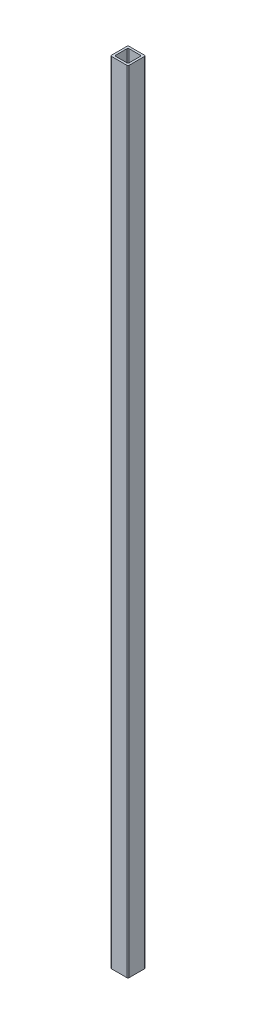
ISO-10303-21;
HEADER;
FILE_DESCRIPTION(('STEP AP214'),'2;1');
FILE_NAME('part.step','',(''),(''),'','','');
FILE_SCHEMA(('AUTOMOTIVE_DESIGN { 1 0 10303 214 1 1 1 1 }'));
ENDSEC;
DATA;
#1=APPLICATION_CONTEXT('core data for automotive mechanical design processes');
#2=APPLICATION_PROTOCOL_DEFINITION('international standard','automotive_design',2000,#1);
#3=PRODUCT_CONTEXT('',#1,'mechanical');
#4=PRODUCT('Part','Part','',(#3));
#5=PRODUCT_RELATED_PRODUCT_CATEGORY('part','',(#4));
#6=PRODUCT_DEFINITION_FORMATION('','',#4);
#7=PRODUCT_DEFINITION_CONTEXT('part definition',#1,'design');
#8=PRODUCT_DEFINITION('design','',#6,#7);
#9=PRODUCT_DEFINITION_SHAPE('','',#8);
#10=(LENGTH_UNIT() NAMED_UNIT(*) SI_UNIT(.MILLI.,.METRE.));
#11=(NAMED_UNIT(*) PLANE_ANGLE_UNIT() SI_UNIT($,.RADIAN.));
#12=(NAMED_UNIT(*) SI_UNIT($,.STERADIAN.) SOLID_ANGLE_UNIT());
#13=UNCERTAINTY_MEASURE_WITH_UNIT(LENGTH_MEASURE(1.E-05),#10,'distance_accuracy_value','');
#14=(GEOMETRIC_REPRESENTATION_CONTEXT(3) GLOBAL_UNCERTAINTY_ASSIGNED_CONTEXT((#13)) GLOBAL_UNIT_ASSIGNED_CONTEXT((#10,
#11,#12)) REPRESENTATION_CONTEXT('',''));
#15=CARTESIAN_POINT('',(0.,0.,0.));
#16=DIRECTION('',(0.,0.,1.));
#17=DIRECTION('',(1.,0.,0.));
#18=AXIS2_PLACEMENT_3D('',#15,#16,#17);
#19=CARTESIAN_POINT('',(-12.7,0.,-11.176));
#20=DIRECTION('',(-1.,0.,0.));
#21=DIRECTION('',(0.,0.,1.));
#22=AXIS2_PLACEMENT_3D('',#19,#20,#21);
#23=PLANE('',#22);
#24=DIRECTION('',(0.,1.,0.));
#25=VECTOR('',#24,1.);
#26=CARTESIAN_POINT('',(-12.7,0.,-11.176));
#27=LINE('',#26,#25);
#28=CARTESIAN_POINT('',(-12.7,0.,-11.176));
#29=VERTEX_POINT('',#28);
#30=CARTESIAN_POINT('',(-12.7,1143.,-11.176));
#31=VERTEX_POINT('',#30);
#32=EDGE_CURVE('E133',#29,#31,#27,.T.);
#33=ORIENTED_EDGE('',*,*,#32,.F.);
#34=DIRECTION('',(0.,0.,1.));
#35=VECTOR('',#34,1.);
#36=CARTESIAN_POINT('',(-12.7,0.,0.));
#37=LINE('',#36,#35);
#38=CARTESIAN_POINT('',(-12.7,0.,11.176));
#39=VERTEX_POINT('',#38);
#40=EDGE_CURVE('E191',#29,#39,#37,.T.);
#41=ORIENTED_EDGE('',*,*,#40,.T.);
#42=DIRECTION('',(0.,1.,0.));
#43=VECTOR('',#42,1.);
#44=CARTESIAN_POINT('',(-12.7,0.,11.176));
#45=LINE('',#44,#43);
#46=CARTESIAN_POINT('',(-12.7,1143.,11.176));
#47=VERTEX_POINT('',#46);
#48=EDGE_CURVE('E104',#47,#39,#45,.F.);
#49=ORIENTED_EDGE('',*,*,#48,.F.);
#50=DIRECTION('',(0.,0.,1.));
#51=VECTOR('',#50,1.);
#52=CARTESIAN_POINT('',(-12.7,1143.,0.));
#53=LINE('',#52,#51);
#54=EDGE_CURVE('E132',#31,#47,#53,.T.);
#55=ORIENTED_EDGE('',*,*,#54,.F.);
#56=EDGE_LOOP('',(#33,#41,#49,#55));
#57=FACE_BOUND('',#56,.T.);
#58=ADVANCED_FACE('F17',(#57),#23,.T.);
#59=CARTESIAN_POINT('',(-11.176,0.,11.176));
#60=DIRECTION('',(0.,1.,0.));
#61=DIRECTION('',(0.,0.,1.));
#62=AXIS2_PLACEMENT_3D('',#59,#60,#61);
#63=CYLINDRICAL_SURFACE('',#62,1.524);
#64=ORIENTED_EDGE('',*,*,#48,.T.);
#65=CARTESIAN_POINT('',(-11.176,0.,11.176));
#66=DIRECTION('',(0.,1.,0.));
#67=DIRECTION('',(0.,0.,1.));
#68=AXIS2_PLACEMENT_3D('',#65,#66,#67);
#69=CIRCLE('',#68,1.524);
#70=CARTESIAN_POINT('',(-11.176,0.,12.7));
#71=VERTEX_POINT('',#70);
#72=EDGE_CURVE('E115',#39,#71,#69,.T.);
#73=ORIENTED_EDGE('',*,*,#72,.T.);
#74=DIRECTION('',(0.,1.,0.));
#75=VECTOR('',#74,1.);
#76=CARTESIAN_POINT('',(-11.176,0.,12.7));
#77=LINE('',#76,#75);
#78=CARTESIAN_POINT('',(-11.176,1143.,12.7));
#79=VERTEX_POINT('',#78);
#80=EDGE_CURVE('E109',#79,#71,#77,.F.);
#81=ORIENTED_EDGE('',*,*,#80,.F.);
#82=CARTESIAN_POINT('',(-11.176,1143.,11.176));
#83=DIRECTION('',(0.,1.,0.));
#84=DIRECTION('',(0.,0.,1.));
#85=AXIS2_PLACEMENT_3D('',#82,#83,#84);
#86=CIRCLE('',#85,1.524);
#87=EDGE_CURVE('E20',#47,#79,#86,.T.);
#88=ORIENTED_EDGE('',*,*,#87,.F.);
#89=EDGE_LOOP('',(#64,#73,#81,#88));
#90=FACE_BOUND('',#89,.T.);
#91=ADVANCED_FACE('F111',(#90),#63,.T.);
#92=CARTESIAN_POINT('',(-11.176,0.,12.7));
#93=DIRECTION('',(0.,0.,1.));
#94=DIRECTION('',(1.,0.,0.));
#95=AXIS2_PLACEMENT_3D('',#92,#93,#94);
#96=PLANE('',#95);
#97=ORIENTED_EDGE('',*,*,#80,.T.);
#98=DIRECTION('',(1.,0.,0.));
#99=VECTOR('',#98,1.);
#100=CARTESIAN_POINT('',(0.,0.,12.7));
#101=LINE('',#100,#99);
#102=CARTESIAN_POINT('',(11.176,0.,12.7));
#103=VERTEX_POINT('',#102);
#104=EDGE_CURVE('E189',#71,#103,#101,.T.);
#105=ORIENTED_EDGE('',*,*,#104,.T.);
#106=DIRECTION('',(0.,1.,0.));
#107=VECTOR('',#106,1.);
#108=CARTESIAN_POINT('',(11.176,0.,12.7));
#109=LINE('',#108,#107);
#110=CARTESIAN_POINT('',(11.176,1143.,12.7));
#111=VERTEX_POINT('',#110);
#112=EDGE_CURVE('E118',#111,#103,#109,.F.);
#113=ORIENTED_EDGE('',*,*,#112,.F.);
#114=DIRECTION('',(1.,0.,0.));
#115=VECTOR('',#114,1.);
#116=CARTESIAN_POINT('',(0.,1143.,12.7));
#117=LINE('',#116,#115);
#118=EDGE_CURVE('E121',#79,#111,#117,.T.);
#119=ORIENTED_EDGE('',*,*,#118,.F.);
#120=EDGE_LOOP('',(#97,#105,#113,#119));
#121=FACE_BOUND('',#120,.T.);
#122=ADVANCED_FACE('F122',(#121),#96,.T.);
#123=CARTESIAN_POINT('',(11.176,0.,11.176));
#124=DIRECTION('',(0.,1.,0.));
#125=DIRECTION('',(0.,0.,1.));
#126=AXIS2_PLACEMENT_3D('',#123,#124,#125);
#127=CYLINDRICAL_SURFACE('',#126,1.524);
#128=ORIENTED_EDGE('',*,*,#112,.T.);
#129=CARTESIAN_POINT('',(11.176,0.,11.176));
#130=DIRECTION('',(0.,1.,0.));
#131=DIRECTION('',(0.,0.,1.));
#132=AXIS2_PLACEMENT_3D('',#129,#130,#131);
#133=CIRCLE('',#132,1.524);
#134=CARTESIAN_POINT('',(12.7,0.,11.176));
#135=VERTEX_POINT('',#134);
#136=EDGE_CURVE('E187',#103,#135,#133,.T.);
#137=ORIENTED_EDGE('',*,*,#136,.T.);
#138=DIRECTION('',(0.,1.,0.));
#139=VECTOR('',#138,1.);
#140=CARTESIAN_POINT('',(12.7,0.,11.176));
#141=LINE('',#140,#139);
#142=CARTESIAN_POINT('',(12.7,1143.,11.176));
#143=VERTEX_POINT('',#142);
#144=EDGE_CURVE('E159',#143,#135,#141,.F.);
#145=ORIENTED_EDGE('',*,*,#144,.F.);
#146=CARTESIAN_POINT('',(11.176,1143.,11.176));
#147=DIRECTION('',(0.,1.,0.));
#148=DIRECTION('',(0.,0.,1.));
#149=AXIS2_PLACEMENT_3D('',#146,#147,#148);
#150=CIRCLE('',#149,1.524);
#151=EDGE_CURVE('E127',#111,#143,#150,.T.);
#152=ORIENTED_EDGE('',*,*,#151,.F.);
#153=EDGE_LOOP('',(#128,#137,#145,#152));
#154=FACE_BOUND('',#153,.T.);
#155=ADVANCED_FACE('F417',(#154),#127,.T.);
#156=CARTESIAN_POINT('',(12.7,0.,11.176));
#157=DIRECTION('',(1.,0.,0.));
#158=DIRECTION('',(0.,0.,-1.));
#159=AXIS2_PLACEMENT_3D('',#156,#157,#158);
#160=PLANE('',#159);
#161=ORIENTED_EDGE('',*,*,#144,.T.);
#162=DIRECTION('',(0.,0.,1.));
#163=VECTOR('',#162,1.);
#164=CARTESIAN_POINT('',(12.7,0.,0.));
#165=LINE('',#164,#163);
#166=CARTESIAN_POINT('',(12.7,0.,-11.176));
#167=VERTEX_POINT('',#166);
#168=EDGE_CURVE('E186',#135,#167,#165,.F.);
#169=ORIENTED_EDGE('',*,*,#168,.T.);
#170=DIRECTION('',(0.,1.,0.));
#171=VECTOR('',#170,1.);
#172=CARTESIAN_POINT('',(12.7,0.,-11.176));
#173=LINE('',#172,#171);
#174=CARTESIAN_POINT('',(12.7,1143.,-11.176));
#175=VERTEX_POINT('',#174);
#176=EDGE_CURVE('E160',#175,#167,#173,.F.);
#177=ORIENTED_EDGE('',*,*,#176,.F.);
#178=DIRECTION('',(0.,0.,1.));
#179=VECTOR('',#178,1.);
#180=CARTESIAN_POINT('',(12.7,1143.,0.));
#181=LINE('',#180,#179);
#182=EDGE_CURVE('E213',#143,#175,#181,.F.);
#183=ORIENTED_EDGE('',*,*,#182,.F.);
#184=EDGE_LOOP('',(#161,#169,#177,#183));
#185=FACE_BOUND('',#184,.T.);
#186=ADVANCED_FACE('F409',(#185),#160,.T.);
#187=CARTESIAN_POINT('',(-8.0772,0.,-9.652));
#188=DIRECTION('',(0.,0.,1.));
#189=DIRECTION('',(1.,0.,0.));
#190=AXIS2_PLACEMENT_3D('',#187,#188,#189);
#191=PLANE('',#190);
#192=DIRECTION('',(0.,1.,0.));
#193=VECTOR('',#192,1.);
#194=CARTESIAN_POINT('',(-8.0772,0.,-9.652));
#195=LINE('',#194,#193);
#196=CARTESIAN_POINT('',(-8.0772,1143.,-9.652));
#197=VERTEX_POINT('',#196);
#198=CARTESIAN_POINT('',(-8.0772,0.,-9.652));
#199=VERTEX_POINT('',#198);
#200=EDGE_CURVE('E136',#197,#199,#195,.F.);
#201=ORIENTED_EDGE('',*,*,#200,.T.);
#202=DIRECTION('',(1.,0.,0.));
#203=VECTOR('',#202,1.);
#204=CARTESIAN_POINT('',(0.,0.,-9.652));
#205=LINE('',#204,#203);
#206=CARTESIAN_POINT('',(8.128,0.,-9.652));
#207=VERTEX_POINT('',#206);
#208=EDGE_CURVE('E184',#199,#207,#205,.T.);
#209=ORIENTED_EDGE('',*,*,#208,.T.);
#210=DIRECTION('',(0.,1.,0.));
#211=VECTOR('',#210,1.);
#212=CARTESIAN_POINT('',(8.128,0.,-9.652));
#213=LINE('',#212,#211);
#214=CARTESIAN_POINT('',(8.128,1143.,-9.652));
#215=VERTEX_POINT('',#214);
#216=EDGE_CURVE('E157',#207,#215,#213,.T.);
#217=ORIENTED_EDGE('',*,*,#216,.T.);
#218=DIRECTION('',(1.,0.,0.));
#219=VECTOR('',#218,1.);
#220=CARTESIAN_POINT('',(0.,1143.,-9.652));
#221=LINE('',#220,#219);
#222=EDGE_CURVE('E196',#197,#215,#221,.T.);
#223=ORIENTED_EDGE('',*,*,#222,.F.);
#224=EDGE_LOOP('',(#201,#209,#217,#223));
#225=FACE_BOUND('',#224,.T.);
#226=ADVANCED_FACE('F266',(#225),#191,.T.);
#227=CARTESIAN_POINT('',(8.128,0.,-8.128));
#228=DIRECTION('',(0.,1.,0.));
#229=DIRECTION('',(0.,0.,1.));
#230=AXIS2_PLACEMENT_3D('',#227,#228,#229);
#231=CYLINDRICAL_SURFACE('',#230,1.524);
#232=CARTESIAN_POINT('',(8.128,1143.,-8.128));
#233=DIRECTION('',(0.,1.,0.));
#234=DIRECTION('',(0.,0.,1.));
#235=AXIS2_PLACEMENT_3D('',#232,#233,#234);
#236=CIRCLE('',#235,1.524);
#237=CARTESIAN_POINT('',(9.652,1143.,-8.128));
#238=VERTEX_POINT('',#237);
#239=EDGE_CURVE('E209',#215,#238,#236,.F.);
#240=ORIENTED_EDGE('',*,*,#239,.F.);
#241=ORIENTED_EDGE('',*,*,#216,.F.);
#242=CARTESIAN_POINT('',(8.128,0.,-8.128));
#243=DIRECTION('',(0.,1.,0.));
#244=DIRECTION('',(0.,0.,1.));
#245=AXIS2_PLACEMENT_3D('',#242,#243,#244);
#246=CIRCLE('',#245,1.524);
#247=CARTESIAN_POINT('',(9.652,0.,-8.128));
#248=VERTEX_POINT('',#247);
#249=EDGE_CURVE('E181',#207,#248,#246,.F.);
#250=ORIENTED_EDGE('',*,*,#249,.T.);
#251=DIRECTION('',(0.,1.,0.));
#252=VECTOR('',#251,1.);
#253=CARTESIAN_POINT('',(9.652,0.,-8.128));
#254=LINE('',#253,#252);
#255=EDGE_CURVE('E154',#238,#248,#254,.F.);
#256=ORIENTED_EDGE('',*,*,#255,.F.);
#257=EDGE_LOOP('',(#240,#241,#250,#256));
#258=FACE_BOUND('',#257,.T.);
#259=ADVANCED_FACE('F272',(#258),#231,.F.);
#260=CARTESIAN_POINT('',(9.652,0.,-8.128));
#261=DIRECTION('',(-1.,0.,0.));
#262=DIRECTION('',(0.,0.,1.));
#263=AXIS2_PLACEMENT_3D('',#260,#261,#262);
#264=PLANE('',#263);
#265=ORIENTED_EDGE('',*,*,#255,.T.);
#266=DIRECTION('',(0.,0.,1.));
#267=VECTOR('',#266,1.);
#268=CARTESIAN_POINT('',(9.652,0.,0.));
#269=LINE('',#268,#267);
#270=CARTESIAN_POINT('',(9.652,0.,8.0772));
#271=VERTEX_POINT('',#270);
#272=EDGE_CURVE('E180',#248,#271,#269,.T.);
#273=ORIENTED_EDGE('',*,*,#272,.T.);
#274=DIRECTION('',(0.,1.,0.));
#275=VECTOR('',#274,1.);
#276=CARTESIAN_POINT('',(9.652,0.,8.0772));
#277=LINE('',#276,#275);
#278=CARTESIAN_POINT('',(9.652,1143.,8.0772));
#279=VERTEX_POINT('',#278);
#280=EDGE_CURVE('E152',#271,#279,#277,.T.);
#281=ORIENTED_EDGE('',*,*,#280,.T.);
#282=DIRECTION('',(0.,0.,1.));
#283=VECTOR('',#282,1.);
#284=CARTESIAN_POINT('',(9.652,1143.,0.));
#285=LINE('',#284,#283);
#286=EDGE_CURVE('E208',#238,#279,#285,.T.);
#287=ORIENTED_EDGE('',*,*,#286,.F.);
#288=EDGE_LOOP('',(#265,#273,#281,#287));
#289=FACE_BOUND('',#288,.T.);
#290=ADVANCED_FACE('F292',(#289),#264,.T.);
#291=CARTESIAN_POINT('',(8.0772,0.,8.0772));
#292=DIRECTION('',(0.,1.,0.));
#293=DIRECTION('',(0.,0.,1.));
#294=AXIS2_PLACEMENT_3D('',#291,#292,#293);
#295=CYLINDRICAL_SURFACE('',#294,1.5748);
#296=CARTESIAN_POINT('',(8.0772,1143.,8.0772));
#297=DIRECTION('',(0.,1.,0.));
#298=DIRECTION('',(0.,0.,1.));
#299=AXIS2_PLACEMENT_3D('',#296,#297,#298);
#300=CIRCLE('',#299,1.5748);
#301=CARTESIAN_POINT('',(8.0772,1143.,9.652));
#302=VERTEX_POINT('',#301);
#303=EDGE_CURVE('E205',#279,#302,#300,.F.);
#304=ORIENTED_EDGE('',*,*,#303,.F.);
#305=ORIENTED_EDGE('',*,*,#280,.F.);
#306=CARTESIAN_POINT('',(8.0772,0.,8.0772));
#307=DIRECTION('',(0.,1.,0.));
#308=DIRECTION('',(0.,0.,1.));
#309=AXIS2_PLACEMENT_3D('',#306,#307,#308);
#310=CIRCLE('',#309,1.5748);
#311=CARTESIAN_POINT('',(8.0772,0.,9.652));
#312=VERTEX_POINT('',#311);
#313=EDGE_CURVE('E177',#271,#312,#310,.F.);
#314=ORIENTED_EDGE('',*,*,#313,.T.);
#315=DIRECTION('',(0.,1.,0.));
#316=VECTOR('',#315,1.);
#317=CARTESIAN_POINT('',(8.0772,0.,9.652));
#318=LINE('',#317,#316);
#319=EDGE_CURVE('E149',#302,#312,#318,.F.);
#320=ORIENTED_EDGE('',*,*,#319,.F.);
#321=EDGE_LOOP('',(#304,#305,#314,#320));
#322=FACE_BOUND('',#321,.T.);
#323=ADVANCED_FACE('F295',(#322),#295,.F.);
#324=CARTESIAN_POINT('',(8.0772,0.,9.652));
#325=DIRECTION('',(0.,0.,-1.));
#326=DIRECTION('',(-1.,0.,0.));
#327=AXIS2_PLACEMENT_3D('',#324,#325,#326);
#328=PLANE('',#327);
#329=ORIENTED_EDGE('',*,*,#319,.T.);
#330=DIRECTION('',(1.,0.,0.));
#331=VECTOR('',#330,1.);
#332=CARTESIAN_POINT('',(0.,0.,9.652));
#333=LINE('',#332,#331);
#334=CARTESIAN_POINT('',(-8.128,0.,9.652));
#335=VERTEX_POINT('',#334);
#336=EDGE_CURVE('E176',#312,#335,#333,.F.);
#337=ORIENTED_EDGE('',*,*,#336,.T.);
#338=DIRECTION('',(0.,1.,0.));
#339=VECTOR('',#338,1.);
#340=CARTESIAN_POINT('',(-8.128,0.,9.652));
#341=LINE('',#340,#339);
#342=CARTESIAN_POINT('',(-8.128,1143.,9.652));
#343=VERTEX_POINT('',#342);
#344=EDGE_CURVE('E147',#335,#343,#341,.T.);
#345=ORIENTED_EDGE('',*,*,#344,.T.);
#346=DIRECTION('',(1.,0.,0.));
#347=VECTOR('',#346,1.);
#348=CARTESIAN_POINT('',(0.,1143.,9.652));
#349=LINE('',#348,#347);
#350=EDGE_CURVE('E204',#302,#343,#349,.F.);
#351=ORIENTED_EDGE('',*,*,#350,.F.);
#352=EDGE_LOOP('',(#329,#337,#345,#351));
#353=FACE_BOUND('',#352,.T.);
#354=ADVANCED_FACE('F296',(#353),#328,.T.);
#355=CARTESIAN_POINT('',(-8.128,0.,8.128));
#356=DIRECTION('',(0.,1.,0.));
#357=DIRECTION('',(0.,0.,1.));
#358=AXIS2_PLACEMENT_3D('',#355,#356,#357);
#359=CYLINDRICAL_SURFACE('',#358,1.524);
#360=CARTESIAN_POINT('',(-8.128,1143.,8.128));
#361=DIRECTION('',(0.,1.,0.));
#362=DIRECTION('',(0.,0.,1.));
#363=AXIS2_PLACEMENT_3D('',#360,#361,#362);
#364=CIRCLE('',#363,1.524);
#365=CARTESIAN_POINT('',(-9.652,1143.,8.128));
#366=VERTEX_POINT('',#365);
#367=EDGE_CURVE('E201',#343,#366,#364,.F.);
#368=ORIENTED_EDGE('',*,*,#367,.F.);
#369=ORIENTED_EDGE('',*,*,#344,.F.);
#370=CARTESIAN_POINT('',(-8.128,0.,8.128));
#371=DIRECTION('',(0.,1.,0.));
#372=DIRECTION('',(0.,0.,1.));
#373=AXIS2_PLACEMENT_3D('',#370,#371,#372);
#374=CIRCLE('',#373,1.524);
#375=CARTESIAN_POINT('',(-9.652,0.,8.128));
#376=VERTEX_POINT('',#375);
#377=EDGE_CURVE('E173',#335,#376,#374,.F.);
#378=ORIENTED_EDGE('',*,*,#377,.T.);
#379=DIRECTION('',(0.,1.,0.));
#380=VECTOR('',#379,1.);
#381=CARTESIAN_POINT('',(-9.652,0.,8.128));
#382=LINE('',#381,#380);
#383=EDGE_CURVE('E144',#366,#376,#382,.F.);
#384=ORIENTED_EDGE('',*,*,#383,.F.);
#385=EDGE_LOOP('',(#368,#369,#378,#384));
#386=FACE_BOUND('',#385,.T.);
#387=ADVANCED_FACE('F279',(#386),#359,.F.);
#388=CARTESIAN_POINT('',(-9.652,0.,8.128));
#389=DIRECTION('',(1.,0.,0.));
#390=DIRECTION('',(0.,0.,-1.));
#391=AXIS2_PLACEMENT_3D('',#388,#389,#390);
#392=PLANE('',#391);
#393=ORIENTED_EDGE('',*,*,#383,.T.);
#394=DIRECTION('',(0.,0.,1.));
#395=VECTOR('',#394,1.);
#396=CARTESIAN_POINT('',(-9.652,0.,0.));
#397=LINE('',#396,#395);
#398=CARTESIAN_POINT('',(-9.652,0.,-8.0772));
#399=VERTEX_POINT('',#398);
#400=EDGE_CURVE('E172',#376,#399,#397,.F.);
#401=ORIENTED_EDGE('',*,*,#400,.T.);
#402=DIRECTION('',(0.,1.,0.));
#403=VECTOR('',#402,1.);
#404=CARTESIAN_POINT('',(-9.652,0.,-8.0772));
#405=LINE('',#404,#403);
#406=CARTESIAN_POINT('',(-9.652,1143.,-8.0772));
#407=VERTEX_POINT('',#406);
#408=EDGE_CURVE('E142',#399,#407,#405,.T.);
#409=ORIENTED_EDGE('',*,*,#408,.T.);
#410=DIRECTION('',(0.,0.,1.));
#411=VECTOR('',#410,1.);
#412=CARTESIAN_POINT('',(-9.652,1143.,0.));
#413=LINE('',#412,#411);
#414=EDGE_CURVE('E200',#366,#407,#413,.F.);
#415=ORIENTED_EDGE('',*,*,#414,.F.);
#416=EDGE_LOOP('',(#393,#401,#409,#415));
#417=FACE_BOUND('',#416,.T.);
#418=ADVANCED_FACE('F246',(#417),#392,.T.);
#419=CARTESIAN_POINT('',(-8.0772,0.,-8.0772));
#420=DIRECTION('',(0.,1.,0.));
#421=DIRECTION('',(0.,0.,1.));
#422=AXIS2_PLACEMENT_3D('',#419,#420,#421);
#423=CYLINDRICAL_SURFACE('',#422,1.5748);
#424=CARTESIAN_POINT('',(-8.0772,1143.,-8.0772));
#425=DIRECTION('',(0.,1.,0.));
#426=DIRECTION('',(0.,0.,1.));
#427=AXIS2_PLACEMENT_3D('',#424,#425,#426);
#428=CIRCLE('',#427,1.5748);
#429=EDGE_CURVE('E197',#407,#197,#428,.F.);
#430=ORIENTED_EDGE('',*,*,#429,.F.);
#431=ORIENTED_EDGE('',*,*,#408,.F.);
#432=CARTESIAN_POINT('',(-8.0772,0.,-8.0772));
#433=DIRECTION('',(0.,1.,0.));
#434=DIRECTION('',(0.,0.,1.));
#435=AXIS2_PLACEMENT_3D('',#432,#433,#434);
#436=CIRCLE('',#435,1.5748);
#437=EDGE_CURVE('E168',#399,#199,#436,.F.);
#438=ORIENTED_EDGE('',*,*,#437,.T.);
#439=ORIENTED_EDGE('',*,*,#200,.F.);
#440=EDGE_LOOP('',(#430,#431,#438,#439));
#441=FACE_BOUND('',#440,.T.);
#442=ADVANCED_FACE('F255',(#441),#423,.F.);
#443=CARTESIAN_POINT('',(-11.176,0.,-11.176));
#444=DIRECTION('',(0.,1.,0.));
#445=DIRECTION('',(0.,0.,1.));
#446=AXIS2_PLACEMENT_3D('',#443,#444,#445);
#447=CYLINDRICAL_SURFACE('',#446,1.524);
#448=DIRECTION('',(0.,1.,0.));
#449=VECTOR('',#448,1.);
#450=CARTESIAN_POINT('',(-11.176,0.,-12.7));
#451=LINE('',#450,#449);
#452=CARTESIAN_POINT('',(-11.176,0.,-12.7));
#453=VERTEX_POINT('',#452);
#454=CARTESIAN_POINT('',(-11.176,1143.,-12.7));
#455=VERTEX_POINT('',#454);
#456=EDGE_CURVE('E171',#453,#455,#451,.T.);
#457=ORIENTED_EDGE('',*,*,#456,.F.);
#458=CARTESIAN_POINT('',(-11.176,0.,-11.176));
#459=DIRECTION('',(0.,1.,0.));
#460=DIRECTION('',(0.,0.,1.));
#461=AXIS2_PLACEMENT_3D('',#458,#459,#460);
#462=CIRCLE('',#461,1.524);
#463=EDGE_CURVE('E162',#453,#29,#462,.T.);
#464=ORIENTED_EDGE('',*,*,#463,.T.);
#465=ORIENTED_EDGE('',*,*,#32,.T.);
#466=CARTESIAN_POINT('',(-11.176,1143.,-11.176));
#467=DIRECTION('',(0.,1.,0.));
#468=DIRECTION('',(0.,0.,1.));
#469=AXIS2_PLACEMENT_3D('',#466,#467,#468);
#470=CIRCLE('',#469,1.524);
#471=EDGE_CURVE('E212',#455,#31,#470,.T.);
#472=ORIENTED_EDGE('',*,*,#471,.F.);
#473=EDGE_LOOP('',(#457,#464,#465,#472));
#474=FACE_BOUND('',#473,.T.);
#475=ADVANCED_FACE('F320',(#474),#447,.T.);
#476=CARTESIAN_POINT('',(0.,1143.,0.));
#477=DIRECTION('',(0.,1.,0.));
#478=DIRECTION('',(0.,0.,1.));
#479=AXIS2_PLACEMENT_3D('',#476,#477,#478);
#480=PLANE('',#479);
#481=ORIENTED_EDGE('',*,*,#429,.T.);
#482=ORIENTED_EDGE('',*,*,#222,.T.);
#483=ORIENTED_EDGE('',*,*,#239,.T.);
#484=ORIENTED_EDGE('',*,*,#286,.T.);
#485=ORIENTED_EDGE('',*,*,#303,.T.);
#486=ORIENTED_EDGE('',*,*,#350,.T.);
#487=ORIENTED_EDGE('',*,*,#367,.T.);
#488=ORIENTED_EDGE('',*,*,#414,.T.);
#489=EDGE_LOOP('',(#481,#482,#483,#484,#485,#486,#487,#488));
#490=FACE_BOUND('',#489,.T.);
#491=DIRECTION('',(-1.,0.,0.));
#492=VECTOR('',#491,1.);
#493=CARTESIAN_POINT('',(11.176,1143.,-12.7));
#494=LINE('',#493,#492);
#495=CARTESIAN_POINT('',(11.176,1143.,-12.7));
#496=VERTEX_POINT('',#495);
#497=EDGE_CURVE('E225',#455,#496,#494,.F.);
#498=ORIENTED_EDGE('',*,*,#497,.F.);
#499=ORIENTED_EDGE('',*,*,#471,.T.);
#500=ORIENTED_EDGE('',*,*,#54,.T.);
#501=ORIENTED_EDGE('',*,*,#87,.T.);
#502=ORIENTED_EDGE('',*,*,#118,.T.);
#503=ORIENTED_EDGE('',*,*,#151,.T.);
#504=ORIENTED_EDGE('',*,*,#182,.T.);
#505=CARTESIAN_POINT('',(11.176,1143.,-11.176));
#506=DIRECTION('',(0.,1.,0.));
#507=DIRECTION('',(0.,0.,1.));
#508=AXIS2_PLACEMENT_3D('',#505,#506,#507);
#509=CIRCLE('',#508,1.524);
#510=EDGE_CURVE('E163',#496,#175,#509,.F.);
#511=ORIENTED_EDGE('',*,*,#510,.F.);
#512=EDGE_LOOP('',(#498,#499,#500,#501,#502,#503,#504,#511));
#513=FACE_BOUND('',#512,.T.);
#514=ADVANCED_FACE('F130',(#490,#513),#480,.T.);
#515=CARTESIAN_POINT('',(11.176,0.,-11.176));
#516=DIRECTION('',(0.,1.,0.));
#517=DIRECTION('',(0.,0.,1.));
#518=AXIS2_PLACEMENT_3D('',#515,#516,#517);
#519=CYLINDRICAL_SURFACE('',#518,1.524);
#520=ORIENTED_EDGE('',*,*,#176,.T.);
#521=CARTESIAN_POINT('',(11.176,0.,-11.176));
#522=DIRECTION('',(0.,1.,0.));
#523=DIRECTION('',(0.,0.,1.));
#524=AXIS2_PLACEMENT_3D('',#521,#522,#523);
#525=CIRCLE('',#524,1.524);
#526=CARTESIAN_POINT('',(11.176,0.,-12.7));
#527=VERTEX_POINT('',#526);
#528=EDGE_CURVE('E35',#167,#527,#525,.T.);
#529=ORIENTED_EDGE('',*,*,#528,.T.);
#530=DIRECTION('',(0.,1.,0.));
#531=VECTOR('',#530,1.);
#532=CARTESIAN_POINT('',(11.176,0.,-12.7));
#533=LINE('',#532,#531);
#534=EDGE_CURVE('E26',#496,#527,#533,.F.);
#535=ORIENTED_EDGE('',*,*,#534,.F.);
#536=ORIENTED_EDGE('',*,*,#510,.T.);
#537=EDGE_LOOP('',(#520,#529,#535,#536));
#538=FACE_BOUND('',#537,.T.);
#539=ADVANCED_FACE('F313',(#538),#519,.T.);
#540=CARTESIAN_POINT('',(0.,0.,0.));
#541=DIRECTION('',(0.,1.,0.));
#542=DIRECTION('',(0.,0.,1.));
#543=AXIS2_PLACEMENT_3D('',#540,#541,#542);
#544=PLANE('',#543);
#545=ORIENTED_EDGE('',*,*,#400,.F.);
#546=ORIENTED_EDGE('',*,*,#377,.F.);
#547=ORIENTED_EDGE('',*,*,#336,.F.);
#548=ORIENTED_EDGE('',*,*,#313,.F.);
#549=ORIENTED_EDGE('',*,*,#272,.F.);
#550=ORIENTED_EDGE('',*,*,#249,.F.);
#551=ORIENTED_EDGE('',*,*,#208,.F.);
#552=ORIENTED_EDGE('',*,*,#437,.F.);
#553=EDGE_LOOP('',(#545,#546,#547,#548,#549,#550,#551,#552));
#554=FACE_BOUND('',#553,.T.);
#555=ORIENTED_EDGE('',*,*,#528,.F.);
#556=ORIENTED_EDGE('',*,*,#168,.F.);
#557=ORIENTED_EDGE('',*,*,#136,.F.);
#558=ORIENTED_EDGE('',*,*,#104,.F.);
#559=ORIENTED_EDGE('',*,*,#72,.F.);
#560=ORIENTED_EDGE('',*,*,#40,.F.);
#561=ORIENTED_EDGE('',*,*,#463,.F.);
#562=DIRECTION('',(-1.,0.,0.));
#563=VECTOR('',#562,1.);
#564=CARTESIAN_POINT('',(11.176,0.,-12.7));
#565=LINE('',#564,#563);
#566=EDGE_CURVE('E11',#527,#453,#565,.T.);
#567=ORIENTED_EDGE('',*,*,#566,.F.);
#568=EDGE_LOOP('',(#555,#556,#557,#558,#559,#560,#561,#567));
#569=FACE_BOUND('',#568,.T.);
#570=ADVANCED_FACE('F258',(#554,#569),#544,.F.);
#571=CARTESIAN_POINT('',(11.176,0.,-12.7));
#572=DIRECTION('',(0.,0.,-1.));
#573=DIRECTION('',(-1.,0.,0.));
#574=AXIS2_PLACEMENT_3D('',#571,#572,#573);
#575=PLANE('',#574);
#576=ORIENTED_EDGE('',*,*,#534,.T.);
#577=ORIENTED_EDGE('',*,*,#566,.T.);
#578=ORIENTED_EDGE('',*,*,#456,.T.);
#579=ORIENTED_EDGE('',*,*,#497,.T.);
#580=EDGE_LOOP('',(#576,#577,#578,#579));
#581=FACE_BOUND('',#580,.T.);
#582=ADVANCED_FACE('F306',(#581),#575,.T.);
#583=CLOSED_SHELL('',(#58,#91,#122,#155,#186,#226,#259,#290,#323,#354,#387,#418,#442,#475,#514,
#539,#570,#582));
#584=MANIFOLD_SOLID_BREP('B1',#583);
#585=ADVANCED_BREP_SHAPE_REPRESENTATION('',(#18,#584),#14);
#586=SHAPE_DEFINITION_REPRESENTATION(#9,#585);
ENDSEC;
END-ISO-10303-21;
